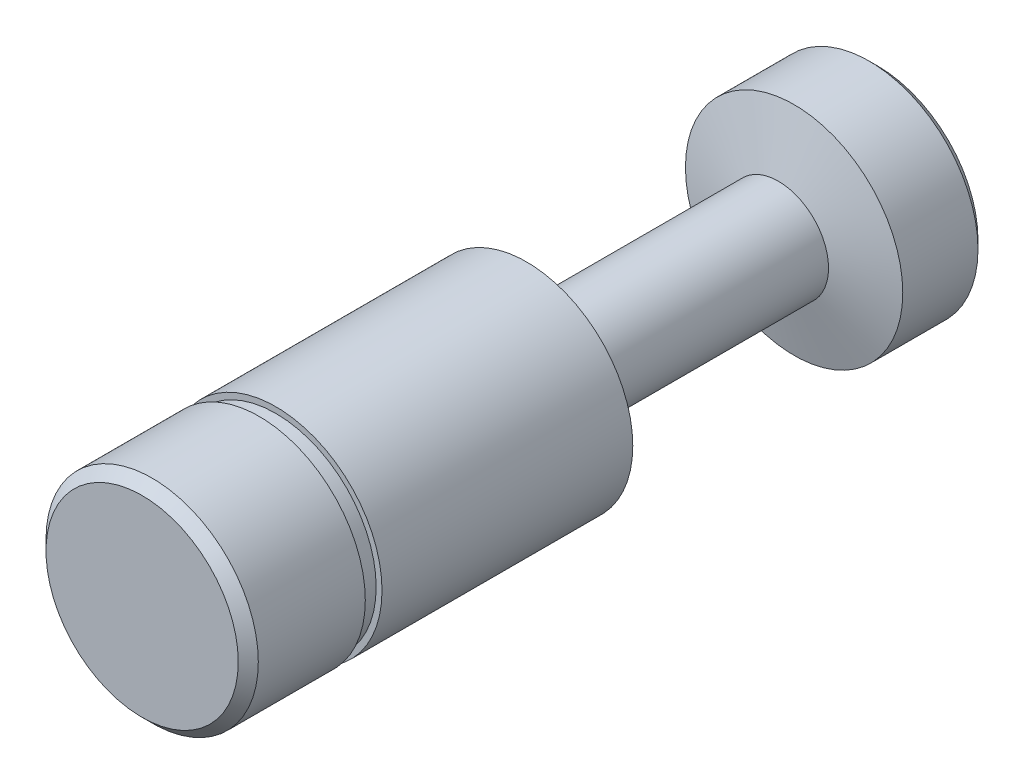
ISO-10303-21;
HEADER;
FILE_DESCRIPTION(('STEP AP214'),'2;1');
FILE_NAME('part.step','',(''),(''),'','','');
FILE_SCHEMA(('AUTOMOTIVE_DESIGN { 1 0 10303 214 1 1 1 1 }'));
ENDSEC;
DATA;
#1=APPLICATION_CONTEXT('core data for automotive mechanical design processes');
#2=APPLICATION_PROTOCOL_DEFINITION('international standard','automotive_design',2000,#1);
#3=PRODUCT_CONTEXT('',#1,'mechanical');
#4=PRODUCT('Part','Part','',(#3));
#5=PRODUCT_RELATED_PRODUCT_CATEGORY('part','',(#4));
#6=PRODUCT_DEFINITION_FORMATION('','',#4);
#7=PRODUCT_DEFINITION_CONTEXT('part definition',#1,'design');
#8=PRODUCT_DEFINITION('design','',#6,#7);
#9=PRODUCT_DEFINITION_SHAPE('','',#8);
#10=(LENGTH_UNIT() NAMED_UNIT(*) SI_UNIT(.MILLI.,.METRE.));
#11=(NAMED_UNIT(*) PLANE_ANGLE_UNIT() SI_UNIT($,.RADIAN.));
#12=(NAMED_UNIT(*) SI_UNIT($,.STERADIAN.) SOLID_ANGLE_UNIT());
#13=UNCERTAINTY_MEASURE_WITH_UNIT(LENGTH_MEASURE(1.E-05),#10,'distance_accuracy_value','');
#14=(GEOMETRIC_REPRESENTATION_CONTEXT(3) GLOBAL_UNCERTAINTY_ASSIGNED_CONTEXT((#13)) GLOBAL_UNIT_ASSIGNED_CONTEXT((#10,
#11,#12)) REPRESENTATION_CONTEXT('',''));
#15=CARTESIAN_POINT('',(0.,0.,0.));
#16=DIRECTION('',(0.,0.,1.));
#17=DIRECTION('',(1.,0.,0.));
#18=AXIS2_PLACEMENT_3D('',#15,#16,#17);
#19=CARTESIAN_POINT('',(0.,0.,-38.06));
#20=DIRECTION('',(0.,0.,1.));
#21=DIRECTION('',(1.,0.,0.));
#22=AXIS2_PLACEMENT_3D('',#19,#20,#21);
#23=CYLINDRICAL_SURFACE('',#22,3.);
#24=CARTESIAN_POINT('',(0.,0.,-38.06));
#25=DIRECTION('',(0.,0.,1.));
#26=DIRECTION('',(1.,0.,0.));
#27=AXIS2_PLACEMENT_3D('',#24,#25,#26);
#28=CIRCLE('',#27,3.);
#29=CARTESIAN_POINT('',(3.,0.,-38.06));
#30=VERTEX_POINT('',#29);
#31=EDGE_CURVE('E43',#30,#30,#28,.T.);
#32=ORIENTED_EDGE('',*,*,#31,.T.);
#33=EDGE_LOOP('',(#32));
#34=FACE_BOUND('',#33,.T.);
#35=CARTESIAN_POINT('',(0.,0.,-24.93));
#36=DIRECTION('',(0.,0.,1.));
#37=DIRECTION('',(1.,0.,0.));
#38=AXIS2_PLACEMENT_3D('',#35,#36,#37);
#39=CIRCLE('',#38,3.);
#40=CARTESIAN_POINT('',(3.,0.,-24.93));
#41=VERTEX_POINT('',#40);
#42=EDGE_CURVE('E46',#41,#41,#39,.T.);
#43=ORIENTED_EDGE('',*,*,#42,.F.);
#44=EDGE_LOOP('',(#43));
#45=FACE_BOUND('',#44,.T.);
#46=ADVANCED_FACE('F13',(#34,#45),#23,.T.);
#47=CARTESIAN_POINT('',(0.,0.,-44.));
#48=DIRECTION('',(0.,0.,1.));
#49=DIRECTION('',(1.,0.,0.));
#50=AXIS2_PLACEMENT_3D('',#47,#48,#49);
#51=PLANE('',#50);
#52=CARTESIAN_POINT('',(0.,0.,-44.));
#53=DIRECTION('',(0.,0.,1.));
#54=DIRECTION('',(1.,0.,0.));
#55=AXIS2_PLACEMENT_3D('',#52,#53,#54);
#56=CIRCLE('',#55,6.);
#57=CARTESIAN_POINT('',(6.,0.,-44.));
#58=VERTEX_POINT('',#57);
#59=EDGE_CURVE('E9',#58,#58,#56,.F.);
#60=ORIENTED_EDGE('',*,*,#59,.T.);
#61=EDGE_LOOP('',(#60));
#62=FACE_BOUND('',#61,.T.);
#63=ADVANCED_FACE('F80',(#62),#51,.F.);
#64=CARTESIAN_POINT('',(0.,0.,-44.));
#65=DIRECTION('',(0.,0.,1.));
#66=DIRECTION('',(1.,0.,0.));
#67=AXIS2_PLACEMENT_3D('',#64,#65,#66);
#68=CYLINDRICAL_SURFACE('',#67,6.5);
#69=CARTESIAN_POINT('',(0.,0.,-43.5));
#70=DIRECTION('',(0.,0.,1.));
#71=DIRECTION('',(1.,0.,0.));
#72=AXIS2_PLACEMENT_3D('',#69,#70,#71);
#73=CIRCLE('',#72,6.5);
#74=CARTESIAN_POINT('',(6.5,0.,-43.5));
#75=VERTEX_POINT('',#74);
#76=EDGE_CURVE('E20',#75,#75,#73,.T.);
#77=ORIENTED_EDGE('',*,*,#76,.T.);
#78=EDGE_LOOP('',(#77));
#79=FACE_BOUND('',#78,.T.);
#80=CARTESIAN_POINT('',(0.,0.,-39.));
#81=DIRECTION('',(0.,0.,1.));
#82=DIRECTION('',(1.,0.,0.));
#83=AXIS2_PLACEMENT_3D('',#80,#81,#82);
#84=CIRCLE('',#83,6.5);
#85=CARTESIAN_POINT('',(6.5,0.,-39.));
#86=VERTEX_POINT('',#85);
#87=EDGE_CURVE('E24',#86,#86,#84,.F.);
#88=ORIENTED_EDGE('',*,*,#87,.T.);
#89=EDGE_LOOP('',(#88));
#90=FACE_BOUND('',#89,.T.);
#91=ADVANCED_FACE('F86',(#79,#90),#68,.T.);
#92=CARTESIAN_POINT('',(0.,0.,-24.93));
#93=DIRECTION('',(0.,0.,1.));
#94=DIRECTION('',(1.,0.,0.));
#95=AXIS2_PLACEMENT_3D('',#92,#93,#94);
#96=CYLINDRICAL_SURFACE('',#95,6.35);
#97=CARTESIAN_POINT('',(0.,0.,-23.));
#98=DIRECTION('',(0.,0.,1.));
#99=DIRECTION('',(1.,0.,0.));
#100=AXIS2_PLACEMENT_3D('',#97,#98,#99);
#101=CIRCLE('',#100,6.35);
#102=CARTESIAN_POINT('',(6.35,0.,-23.));
#103=VERTEX_POINT('',#102);
#104=EDGE_CURVE('E28',#103,#103,#101,.T.);
#105=ORIENTED_EDGE('',*,*,#104,.T.);
#106=EDGE_LOOP('',(#105));
#107=FACE_BOUND('',#106,.T.);
#108=CARTESIAN_POINT('',(0.,0.,-8.));
#109=DIRECTION('',(0.,0.,1.));
#110=DIRECTION('',(1.,0.,0.));
#111=AXIS2_PLACEMENT_3D('',#108,#109,#110);
#112=CIRCLE('',#111,6.35);
#113=CARTESIAN_POINT('',(6.35,0.,-8.));
#114=VERTEX_POINT('',#113);
#115=EDGE_CURVE('E49',#114,#114,#112,.T.);
#116=ORIENTED_EDGE('',*,*,#115,.F.);
#117=EDGE_LOOP('',(#116));
#118=FACE_BOUND('',#117,.T.);
#119=ADVANCED_FACE('F73',(#107,#118),#96,.T.);
#120=CARTESIAN_POINT('',(0.,0.,-8.));
#121=DIRECTION('',(0.,0.,1.));
#122=DIRECTION('',(1.,0.,0.));
#123=AXIS2_PLACEMENT_3D('',#120,#121,#122);
#124=PLANE('',#123);
#125=CARTESIAN_POINT('',(0.,0.,-8.));
#126=DIRECTION('',(0.,0.,1.));
#127=DIRECTION('',(1.,0.,0.));
#128=AXIS2_PLACEMENT_3D('',#125,#126,#127);
#129=CIRCLE('',#128,6.);
#130=CARTESIAN_POINT('',(6.,0.,-8.));
#131=VERTEX_POINT('',#130);
#132=EDGE_CURVE('E39',#131,#131,#129,.T.);
#133=ORIENTED_EDGE('',*,*,#132,.F.);
#134=EDGE_LOOP('',(#133));
#135=FACE_BOUND('',#134,.T.);
#136=ORIENTED_EDGE('',*,*,#115,.T.);
#137=EDGE_LOOP('',(#136));
#138=FACE_BOUND('',#137,.T.);
#139=ADVANCED_FACE('F74',(#135,#138),#124,.T.);
#140=CARTESIAN_POINT('',(0.,0.,-8.));
#141=DIRECTION('',(0.,0.,1.));
#142=DIRECTION('',(1.,0.,0.));
#143=AXIS2_PLACEMENT_3D('',#140,#141,#142);
#144=CYLINDRICAL_SURFACE('',#143,6.);
#145=ORIENTED_EDGE('',*,*,#132,.T.);
#146=EDGE_LOOP('',(#145));
#147=FACE_BOUND('',#146,.T.);
#148=CARTESIAN_POINT('',(0.,0.,-7.));
#149=DIRECTION('',(0.,0.,1.));
#150=DIRECTION('',(1.,0.,0.));
#151=AXIS2_PLACEMENT_3D('',#148,#149,#150);
#152=CIRCLE('',#151,6.);
#153=CARTESIAN_POINT('',(6.,0.,-7.));
#154=VERTEX_POINT('',#153);
#155=EDGE_CURVE('E40',#154,#154,#152,.T.);
#156=ORIENTED_EDGE('',*,*,#155,.F.);
#157=EDGE_LOOP('',(#156));
#158=FACE_BOUND('',#157,.T.);
#159=ADVANCED_FACE('F62',(#147,#158),#144,.T.);
#160=CARTESIAN_POINT('',(0.,0.,-7.));
#161=DIRECTION('',(0.,0.,1.));
#162=DIRECTION('',(1.,0.,0.));
#163=AXIS2_PLACEMENT_3D('',#160,#161,#162);
#164=PLANE('',#163);
#165=ORIENTED_EDGE('',*,*,#155,.T.);
#166=EDGE_LOOP('',(#165));
#167=FACE_BOUND('',#166,.T.);
#168=CARTESIAN_POINT('',(0.,0.,-7.));
#169=DIRECTION('',(0.,0.,1.));
#170=DIRECTION('',(1.,0.,0.));
#171=AXIS2_PLACEMENT_3D('',#168,#169,#170);
#172=CIRCLE('',#171,6.35);
#173=CARTESIAN_POINT('',(6.35,0.,-7.));
#174=VERTEX_POINT('',#173);
#175=EDGE_CURVE('E54',#174,#174,#172,.T.);
#176=ORIENTED_EDGE('',*,*,#175,.F.);
#177=EDGE_LOOP('',(#176));
#178=FACE_BOUND('',#177,.T.);
#179=ADVANCED_FACE('F60',(#167,#178),#164,.F.);
#180=CARTESIAN_POINT('',(0.,0.,-0.60000000000001));
#181=DIRECTION('',(0.,0.,1.));
#182=DIRECTION('',(1.,0.,0.));
#183=AXIS2_PLACEMENT_3D('',#180,#181,#182);
#184=CIRCLE('',#183,6.35);
#185=CARTESIAN_POINT('',(6.35,0.,-0.60000000000001));
#186=VERTEX_POINT('',#185);
#187=EDGE_CURVE('E33',#186,#186,#184,.F.);
#188=ORIENTED_EDGE('',*,*,#187,.T.);
#189=EDGE_LOOP('',(#188));
#190=FACE_BOUND('',#189,.T.);
#191=ORIENTED_EDGE('',*,*,#175,.T.);
#192=EDGE_LOOP('',(#191));
#193=FACE_BOUND('',#192,.T.);
#194=ADVANCED_FACE('F58',(#190,#193),#96,.T.);
#195=CARTESIAN_POINT('',(0.,0.,0.));
#196=DIRECTION('',(0.,0.,1.));
#197=DIRECTION('',(1.,0.,0.));
#198=AXIS2_PLACEMENT_3D('',#195,#196,#197);
#199=PLANE('',#198);
#200=CARTESIAN_POINT('',(0.,0.,0.));
#201=DIRECTION('',(0.,0.,1.));
#202=DIRECTION('',(1.,0.,0.));
#203=AXIS2_PLACEMENT_3D('',#200,#201,#202);
#204=CIRCLE('',#203,5.75);
#205=CARTESIAN_POINT('',(5.75,0.,0.));
#206=VERTEX_POINT('',#205);
#207=EDGE_CURVE('E36',#206,#206,#204,.T.);
#208=ORIENTED_EDGE('',*,*,#207,.T.);
#209=EDGE_LOOP('',(#208));
#210=FACE_BOUND('',#209,.T.);
#211=ADVANCED_FACE('F70',(#210),#199,.T.);
#212=CARTESIAN_POINT('',(0.,0.,0.));
#213=DIRECTION('',(0.,0.,-1.));
#214=DIRECTION('',(-1.,0.,0.));
#215=AXIS2_PLACEMENT_3D('',#212,#213,#214);
#216=CONICAL_SURFACE('',#215,5.75,0.785398163397441);
#217=ORIENTED_EDGE('',*,*,#187,.F.);
#218=EDGE_LOOP('',(#217));
#219=FACE_BOUND('',#218,.T.);
#220=ORIENTED_EDGE('',*,*,#207,.F.);
#221=EDGE_LOOP('',(#220));
#222=FACE_BOUND('',#221,.T.);
#223=ADVANCED_FACE('F109',(#219,#222),#216,.T.);
#224=CARTESIAN_POINT('',(0.,0.,-23.));
#225=DIRECTION('',(0.,0.,1.));
#226=DIRECTION('',(1.,0.,0.));
#227=AXIS2_PLACEMENT_3D('',#224,#225,#226);
#228=CONICAL_SURFACE('',#227,6.35,1.04812119287068);
#229=ORIENTED_EDGE('',*,*,#42,.T.);
#230=EDGE_LOOP('',(#229));
#231=FACE_BOUND('',#230,.T.);
#232=ORIENTED_EDGE('',*,*,#104,.F.);
#233=EDGE_LOOP('',(#232));
#234=FACE_BOUND('',#233,.T.);
#235=ADVANCED_FACE('F106',(#231,#234),#228,.T.);
#236=CARTESIAN_POINT('',(0.,0.,-38.06));
#237=DIRECTION('',(0.,0.,-1.));
#238=DIRECTION('',(-1.,0.,0.));
#239=AXIS2_PLACEMENT_3D('',#236,#237,#238);
#240=CONICAL_SURFACE('',#239,2.99999999999995,1.30841647513487);
#241=ORIENTED_EDGE('',*,*,#87,.F.);
#242=EDGE_LOOP('',(#241));
#243=FACE_BOUND('',#242,.T.);
#244=ORIENTED_EDGE('',*,*,#31,.F.);
#245=EDGE_LOOP('',(#244));
#246=FACE_BOUND('',#245,.T.);
#247=ADVANCED_FACE('F108',(#243,#246),#240,.T.);
#248=CARTESIAN_POINT('',(0.,0.,-43.5));
#249=DIRECTION('',(0.,0.,1.));
#250=DIRECTION('',(1.,0.,0.));
#251=AXIS2_PLACEMENT_3D('',#248,#249,#250);
#252=CONICAL_SURFACE('',#251,6.5,0.78539816339745);
#253=ORIENTED_EDGE('',*,*,#59,.F.);
#254=EDGE_LOOP('',(#253));
#255=FACE_BOUND('',#254,.T.);
#256=ORIENTED_EDGE('',*,*,#76,.F.);
#257=EDGE_LOOP('',(#256));
#258=FACE_BOUND('',#257,.T.);
#259=ADVANCED_FACE('F15',(#255,#258),#252,.T.);
#260=CLOSED_SHELL('',(#46,#63,#91,#119,#139,#159,#179,#194,#211,#223,#235,#247,#259));
#261=MANIFOLD_SOLID_BREP('B1',#260);
#262=ADVANCED_BREP_SHAPE_REPRESENTATION('',(#18,#261),#14);
#263=SHAPE_DEFINITION_REPRESENTATION(#9,#262);
ENDSEC;
END-ISO-10303-21;
